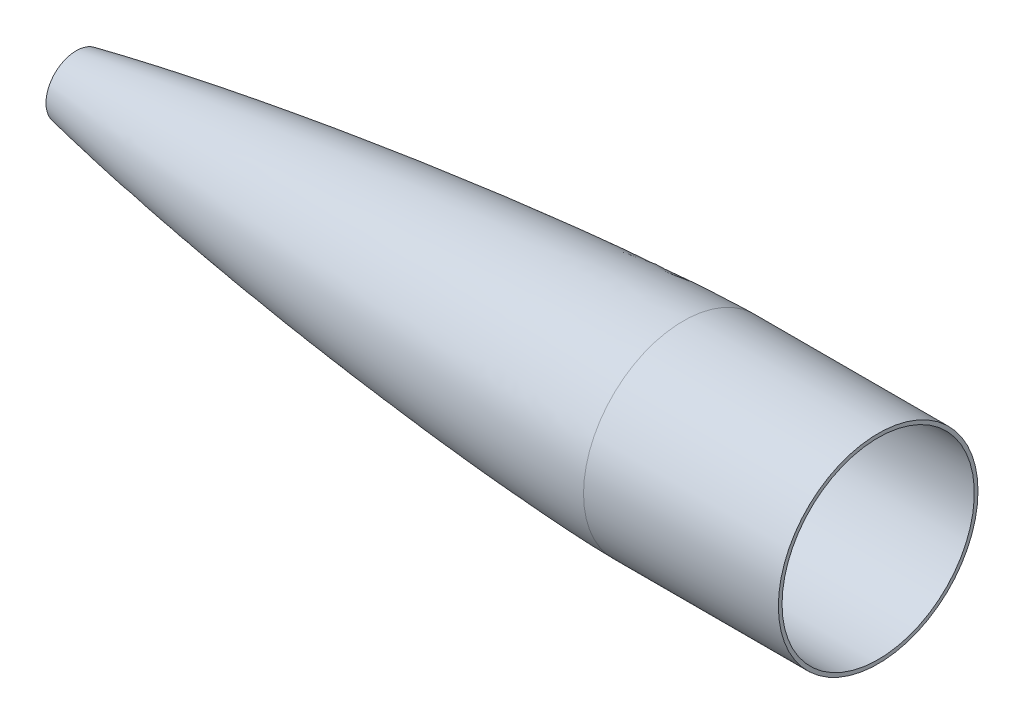
ISO-10303-21;
HEADER;
FILE_DESCRIPTION(('STEP AP214'),'2;1');
FILE_NAME('part.step','',(''),(''),'','','');
FILE_SCHEMA(('AUTOMOTIVE_DESIGN { 1 0 10303 214 1 1 1 1 }'));
ENDSEC;
DATA;
#1=APPLICATION_CONTEXT('core data for automotive mechanical design processes');
#2=APPLICATION_PROTOCOL_DEFINITION('international standard','automotive_design',2000,#1);
#3=PRODUCT_CONTEXT('',#1,'mechanical');
#4=PRODUCT('Part','Part','',(#3));
#5=PRODUCT_RELATED_PRODUCT_CATEGORY('part','',(#4));
#6=PRODUCT_DEFINITION_FORMATION('','',#4);
#7=PRODUCT_DEFINITION_CONTEXT('part definition',#1,'design');
#8=PRODUCT_DEFINITION('design','',#6,#7);
#9=PRODUCT_DEFINITION_SHAPE('','',#8);
#10=(LENGTH_UNIT() NAMED_UNIT(*) SI_UNIT(.MILLI.,.METRE.));
#11=(NAMED_UNIT(*) PLANE_ANGLE_UNIT() SI_UNIT($,.RADIAN.));
#12=(NAMED_UNIT(*) SI_UNIT($,.STERADIAN.) SOLID_ANGLE_UNIT());
#13=UNCERTAINTY_MEASURE_WITH_UNIT(LENGTH_MEASURE(1.E-05),#10,'distance_accuracy_value','');
#14=(GEOMETRIC_REPRESENTATION_CONTEXT(3) GLOBAL_UNCERTAINTY_ASSIGNED_CONTEXT((#13)) GLOBAL_UNIT_ASSIGNED_CONTEXT((#10,
#11,#12)) REPRESENTATION_CONTEXT('',''));
#15=CARTESIAN_POINT('',(0.,0.,0.));
#16=DIRECTION('',(0.,0.,1.));
#17=DIRECTION('',(1.,0.,0.));
#18=AXIS2_PLACEMENT_3D('',#15,#16,#17);
#19=CARTESIAN_POINT('',(27.9569835045705,0.,0.));
#20=DIRECTION('',(-1.,0.,0.));
#21=DIRECTION('',(0.,0.,1.));
#22=AXIS2_PLACEMENT_3D('',#19,#20,#21);
#23=CYLINDRICAL_SURFACE('',#22,41.099994);
#24=CARTESIAN_POINT('',(294.248097670656,0.,0.));
#25=DIRECTION('',(-1.,0.,0.));
#26=DIRECTION('',(0.,0.,1.));
#27=AXIS2_PLACEMENT_3D('',#24,#25,#26);
#28=CIRCLE('',#27,41.099994);
#29=CARTESIAN_POINT('',(294.248097670656,0.,41.099994));
#30=VERTEX_POINT('',#29);
#31=EDGE_CURVE('E10',#30,#30,#28,.T.);
#32=ORIENTED_EDGE('',*,*,#31,.F.);
#33=EDGE_LOOP('',(#32));
#34=FACE_BOUND('',#33,.T.);
#35=CARTESIAN_POINT('',(374.461362015152,0.,0.));
#36=DIRECTION('',(-1.,0.,0.));
#37=DIRECTION('',(0.,0.,1.));
#38=AXIS2_PLACEMENT_3D('',#35,#36,#37);
#39=CIRCLE('',#38,41.099994);
#40=CARTESIAN_POINT('',(374.461362015152,0.,41.099994));
#41=VERTEX_POINT('',#40);
#42=EDGE_CURVE('E37',#41,#41,#39,.T.);
#43=ORIENTED_EDGE('',*,*,#42,.T.);
#44=EDGE_LOOP('',(#43));
#45=FACE_BOUND('',#44,.T.);
#46=ADVANCED_FACE('F30',(#34,#45),#23,.T.);
#47=CARTESIAN_POINT('',(294.248097670656,41.099994,0.));
#48=CARTESIAN_POINT('',(293.349585578984,41.0929766307083,0.));
#49=CARTESIAN_POINT('',(291.552749441752,41.0620120145708,0.));
#50=CARTESIAN_POINT('',(287.959615598992,40.9757312395162,0.));
#51=CARTESIAN_POINT('',(279.731843335379,40.6955904474829,0.));
#52=CARTESIAN_POINT('',(267.77278785745,40.126983688346,0.));
#53=CARTESIAN_POINT('',(252.089784541244,39.1672522410937,0.));
#54=CARTESIAN_POINT('',(233.587543701493,37.7898429209365,0.));
#55=CARTESIAN_POINT('',(215.101974731597,36.2057496701159,0.));
#56=CARTESIAN_POINT('',(196.633402792594,34.4347648268857,0.));
#57=CARTESIAN_POINT('',(178.182568699461,32.4880556238183,0.));
#58=CARTESIAN_POINT('',(159.750571571185,30.370263808706,0.));
#59=CARTESIAN_POINT('',(141.339126247833,28.0808283889295,0.));
#60=CARTESIAN_POINT('',(122.950477297348,25.6144507336649,0.));
#61=CARTESIAN_POINT('',(104.588147950723,22.9593047940946,0.));
#62=CARTESIAN_POINT('',(86.2567835087022,20.0969319952747,0.));
#63=CARTESIAN_POINT('',(67.9644485613736,16.9947995955386,0.));
#64=CARTESIAN_POINT('',(49.7554220048597,13.608995902172,0.));
#65=CARTESIAN_POINT('',(33.8929224206239,10.3082335767929,0.));
#66=CARTESIAN_POINT('',(21.1109853881937,7.28957187002555,0.));
#67=CARTESIAN_POINT('',(12.0631569659046,4.8001398379657,0.));
#68=CARTESIAN_POINT('',(7.04083965915166,3.21251091516102,0.));
#69=CARTESIAN_POINT('',(4.00901358110106,2.1055100653999,0.));
#70=CARTESIAN_POINT('',(2.3272074598022,1.39819501579109,0.));
#71=CARTESIAN_POINT('',(1.39944702482688,0.953571578890638,0.));
#72=CARTESIAN_POINT('',(0.868996869827166,0.666011278433959,0.));
#73=CARTESIAN_POINT('',(0.554676950424698,0.475129112112784,0.));
#74=CARTESIAN_POINT('',(0.368976653655497,0.349691674085785,0.));
#75=CARTESIAN_POINT('',(0.247244705596054,0.258828054370278,0.));
#76=CARTESIAN_POINT('',(0.159124072236465,0.186271130110896,0.));
#77=CARTESIAN_POINT('',(0.0980289359052772,0.130393503108126,0.));
#78=CARTESIAN_POINT('',(0.0516204427505099,0.0815556881046406,0.));
#79=CARTESIAN_POINT('',(0.0199940375063355,0.0404990511720436,0.));
#80=CARTESIAN_POINT('',(0.00649041594704016,0.0182803486310689,0.));
#81=CARTESIAN_POINT('',(0.00182860387418679,0.0062426386909617,0.));
#82=CARTESIAN_POINT('',(0.,0.,0.));
#83=B_SPLINE_CURVE_WITH_KNOTS('',4,(#47,#48,#49,#50,#51,#52,#53,#54,#55,#56,#57,#58,#59,#60,#61,
#62,#63,#64,#65,#66,#67,#68,#69,#70,#71,#72,#73,#74,#75,#76,#77,#78,#79,#80,#81,#82),
.UNSPECIFIED.,.F.,.F.,(5,1,1,1,1,1,1,1,1,1,1,1,1,1,1,1,1,1,1,1,1,1,1,1,1,1,1,1,1,1,1,1,5),(0.,
0.0120599701125952,0.0241199402251903,0.0482398804503805,0.1104935820596,0.172747283844769,
0.235000984013769,0.297254686823773,0.359508386221387,0.421762088339113,0.484015788959948,
0.546269489090148,0.60852319021114,0.670776891466794,0.733030591698496,0.795284289783134,
0.857537990172938,0.919348906793277,0.95047573101264,0.971525230460581,0.983463902787434,
0.99002606304966,0.993781479893161,0.996003962640871,0.997267165840399,0.998121150964244,
0.998715599634537,0.999010469110389,0.999305338586241,0.99965266929312,0.99982633464656,
0.99991316732328,1.),.UNSPECIFIED.);
#84=CARTESIAN_POINT('',(27.9569835045705,0.,0.));
#85=DIRECTION('',(-1.,0.,0.));
#86=AXIS1_PLACEMENT('',#84,#85);
#87=SURFACE_OF_REVOLUTION('',#83,#86);
#88=CARTESIAN_POINT('',(44.2613620151523,0.,0.));
#89=DIRECTION('',(-1.,0.,0.));
#90=DIRECTION('',(0.,0.,1.));
#91=AXIS2_PLACEMENT_3D('',#88,#89,#90);
#92=CIRCLE('',#91,12.4209088225213);
#93=CARTESIAN_POINT('',(44.2613620151523,0.,12.4209088225213));
#94=VERTEX_POINT('',#93);
#95=EDGE_CURVE('E149',#94,#94,#92,.F.);
#96=ORIENTED_EDGE('',*,*,#95,.T.);
#97=EDGE_LOOP('',(#96));
#98=FACE_BOUND('',#97,.T.);
#99=ORIENTED_EDGE('',*,*,#31,.T.);
#100=EDGE_LOOP('',(#99));
#101=FACE_BOUND('',#100,.T.);
#102=ADVANCED_FACE('F53',(#98,#101),#87,.T.);
#103=CARTESIAN_POINT('',(374.461362015152,0.,0.));
#104=DIRECTION('',(-1.,0.,0.));
#105=DIRECTION('',(0.,0.,1.));
#106=AXIS2_PLACEMENT_3D('',#103,#104,#105);
#107=PLANE('',#106);
#108=CARTESIAN_POINT('',(374.461362015152,0.,0.));
#109=DIRECTION('',(-1.,0.,0.));
#110=DIRECTION('',(0.,0.,1.));
#111=AXIS2_PLACEMENT_3D('',#108,#109,#110);
#112=CIRCLE('',#111,39.575994);
#113=CARTESIAN_POINT('',(374.461362015152,0.,39.575994));
#114=VERTEX_POINT('',#113);
#115=EDGE_CURVE('E48',#114,#114,#112,.T.);
#116=ORIENTED_EDGE('',*,*,#115,.T.);
#117=EDGE_LOOP('',(#116));
#118=FACE_BOUND('',#117,.T.);
#119=ORIENTED_EDGE('',*,*,#42,.F.);
#120=EDGE_LOOP('',(#119));
#121=FACE_BOUND('',#120,.T.);
#122=ADVANCED_FACE('F56',(#118,#121),#107,.F.);
#123=CARTESIAN_POINT('',(27.9569835045705,0.,0.));
#124=DIRECTION('',(-1.,0.,0.));
#125=DIRECTION('',(0.,0.,1.));
#126=AXIS2_PLACEMENT_3D('',#123,#124,#125);
#127=CYLINDRICAL_SURFACE('',#126,39.575994);
#128=CARTESIAN_POINT('',(294.259999730352,0.,39.5760404767668));
#129=CARTESIAN_POINT('',(294.259999730349,-0.647562101953458,39.5760542131661));
#130=CARTESIAN_POINT('',(294.259999730347,-1.29512303507392,39.560147416657));
#131=CARTESIAN_POINT('',(294.259999730346,-2.58868549547753,39.4965913889169));
#132=CARTESIAN_POINT('',(294.259999730348,-3.23468702276071,39.4489421576867));
#133=CARTESIAN_POINT('',(294.259999730358,-4.52357360338433,39.3219998915965));
#134=CARTESIAN_POINT('',(294.259999730366,-5.1664586567246,39.2427068567348));
#135=CARTESIAN_POINT('',(294.259999730359,-6.44756373574214,39.0526723373277));
#136=CARTESIAN_POINT('',(294.259999730344,-7.08578376141943,38.9419308527826));
#137=CARTESIAN_POINT('',(294.259999730333,-8.35602120012929,38.6892650597124));
#138=CARTESIAN_POINT('',(294.259999730337,-8.9880386131623,38.5473407511894));
#139=CARTESIAN_POINT('',(294.259999730348,-10.2443482566311,38.232651529126));
#140=CARTESIAN_POINT('',(294.259999730356,-10.8686404870664,38.0598866155837));
#141=CARTESIAN_POINT('',(294.259999730355,-12.1079957865251,37.6839323060009));
#142=CARTESIAN_POINT('',(294.259999730346,-12.7230588555487,37.4807429099614));
#143=CARTESIAN_POINT('',(294.259999730345,-13.9424740925134,37.0444291587465));
#144=CARTESIAN_POINT('',(294.259999730352,-14.5468262604541,36.8113048035703));
#145=CARTESIAN_POINT('',(294.25999973036,-15.7433637576833,36.3156827450759));
#146=CARTESIAN_POINT('',(294.259999730361,-16.3355490869707,36.0531850417553));
#147=CARTESIAN_POINT('',(294.259999730357,-17.5063262805012,35.4994486685928));
#148=CARTESIAN_POINT('',(294.259999730351,-18.0849181447464,35.2082099987554));
#149=CARTESIAN_POINT('',(294.259999730349,-19.2271145298317,34.5976933115373));
#150=CARTESIAN_POINT('',(294.259999730353,-19.7907190506705,34.2784152941544));
#151=CARTESIAN_POINT('',(294.259999730352,-20.901582976203,33.6125890807142));
#152=CARTESIAN_POINT('',(294.259999730347,-21.4488423808979,33.2660408846589));
#153=CARTESIAN_POINT('',(294.259999730343,-22.5256976784342,32.5465091787211));
#154=CARTESIAN_POINT('',(294.259999730345,-23.0552935712727,32.1735256688342));
#155=CARTESIAN_POINT('',(294.25999973035,-24.095546002028,31.4020218852968));
#156=CARTESIAN_POINT('',(294.259999730354,-24.6062025399476,31.0035016116504));
#157=CARTESIAN_POINT('',(294.259999730352,-25.6073460446378,30.1818843707736));
#158=CARTESIAN_POINT('',(294.259999730347,-26.0978330114077,29.7587874035426));
#159=CARTESIAN_POINT('',(294.259999730347,-27.0574557477287,28.8890360531514));
#160=CARTESIAN_POINT('',(294.259999730354,-27.5265915172794,28.4423816699907));
#161=CARTESIAN_POINT('',(294.259999730356,-28.4423816699908,27.5265915172794));
#162=CARTESIAN_POINT('',(294.259999730352,-28.8890360531515,27.0574557477287));
#163=CARTESIAN_POINT('',(294.259999730341,-29.7587874035425,26.0978330114076));
#164=CARTESIAN_POINT('',(294.259999730335,-30.1818843707734,25.6073460446377));
#165=CARTESIAN_POINT('',(294.259999730344,-31.0035016116505,24.6062025399476));
#166=CARTESIAN_POINT('',(294.259999730361,-31.4020218852974,24.095546002028));
#167=CARTESIAN_POINT('',(294.259999730363,-32.1735256688267,23.0552935712823));
#168=CARTESIAN_POINT('',(294.259999730348,-32.5465091787055,22.5256976784536));
#169=CARTESIAN_POINT('',(294.259999730342,-33.2660408846685,21.4488423808875));
#170=CARTESIAN_POINT('',(294.25999973035,-33.6125890807545,20.9015829761514));
#171=CARTESIAN_POINT('',(294.259999730355,-34.2784152941837,19.7907190506062));
#172=CARTESIAN_POINT('',(294.259999730351,-34.5976933115284,19.227114529798));
#173=CARTESIAN_POINT('',(294.259999730346,-35.2082099988138,18.0849181446874));
#174=CARTESIAN_POINT('',(294.259999730344,-35.499448668752,17.5063262803838));
#175=CARTESIAN_POINT('',(294.25999973034,-36.0531850417127,16.3355490868408));
#176=CARTESIAN_POINT('',(294.259999730339,-36.3156827447369,15.7433637576021));
#177=CARTESIAN_POINT('',(294.259999730338,-36.8113048039352,14.546826260472));
#178=CARTESIAN_POINT('',(294.25999973034,-37.0444291601087,13.9424740925803));
#179=CARTESIAN_POINT('',(294.259999730349,-37.4807429085982,12.7230588554847));
#180=CARTESIAN_POINT('',(294.259999730357,-37.6839323009152,12.1079957862813));
#181=CARTESIAN_POINT('',(294.259999730353,-38.0598866206659,10.8686404873222));
#182=CARTESIAN_POINT('',(294.259999730342,-38.2326515480982,10.2443482575662));
#183=CARTESIAN_POINT('',(294.259999730341,-38.547340732217,8.98803861222818));
#184=CARTESIAN_POINT('',(294.259999730353,-38.6892649889054,8.35602119664668));
#185=CARTESIAN_POINT('',(294.259999730357,-38.9419309235996,7.0857837648531));
#186=CARTESIAN_POINT('',(294.25999973035,-39.0526726016015,6.44756374864023));
#187=CARTESIAN_POINT('',(294.259999730338,-39.242706592479,5.16645864370292));
#188=CARTESIAN_POINT('',(294.259999730333,-39.3219989053606,4.52357355497935));
#189=CARTESIAN_POINT('',(294.259999730335,-39.4489431439093,3.23468707129825));
#190=CARTESIAN_POINT('',(294.259999730341,-39.4965950695718,2.58868567634028));
#191=CARTESIAN_POINT('',(294.259999730349,-39.5601437359999,1.29512285425482));
#192=CARTESIAN_POINT('',(294.259999730351,-39.5760404767667,0.6475614271274));
#193=CARTESIAN_POINT('',(294.259999730351,-39.5760404767667,-0.647561427127434));
#194=CARTESIAN_POINT('',(294.259999730349,-39.5601437359999,-1.29512285425485));
#195=CARTESIAN_POINT('',(294.259999730341,-39.4965950695739,-2.58868567629714));
#196=CARTESIAN_POINT('',(294.259999730335,-39.4489431439156,-3.23468707121205));
#197=CARTESIAN_POINT('',(294.259999730333,-39.321998905367,-4.52357355493579));
#198=CARTESIAN_POINT('',(294.259999730338,-39.242706592475,-5.16645864374444));
#199=CARTESIAN_POINT('',(294.25999973035,-39.0526726015928,-6.44756374868434));
#200=CARTESIAN_POINT('',(294.259999730357,-38.941930923605,-7.08578376481593));
#201=CARTESIAN_POINT('',(294.259999730353,-38.6892649889315,-8.35602119652531));
#202=CARTESIAN_POINT('',(294.259999730343,-38.5473407322461,-8.98803861210314));
#203=CARTESIAN_POINT('',(294.25999973034,-38.2326515481225,-10.2443482574779));
#204=CARTESIAN_POINT('',(294.259999730348,-38.0598866206803,-10.8686404872739));
#205=CARTESIAN_POINT('',(294.25999973036,-37.6839323009055,-12.107995786314));
#206=CARTESIAN_POINT('',(294.259999730364,-37.480742908574,-12.7230588555585));
#207=CARTESIAN_POINT('',(294.259999730362,-37.0444291600798,-13.9424740926557));
#208=CARTESIAN_POINT('',(294.259999730356,-36.8113048039199,-14.5468262605093));
#209=CARTESIAN_POINT('',(294.259999730354,-36.3156827447222,-15.743363757638));
#210=CARTESIAN_POINT('',(294.259999730359,-36.0531850416814,-16.3355490869118));
#211=CARTESIAN_POINT('',(294.259999730357,-35.4994486687172,-17.5063262804532));
#212=CARTESIAN_POINT('',(294.25999973035,-35.2082099987955,-18.0849181447216));
#213=CARTESIAN_POINT('',(294.259999730348,-34.5976933115111,-19.2271145298304));
#214=CARTESIAN_POINT('',(294.259999730352,-34.2784152941474,-19.7907190506702));
#215=CARTESIAN_POINT('',(294.259999730352,-33.6125890807151,-20.9015829762136));
#216=CARTESIAN_POINT('',(294.259999730347,-33.2660408846481,-21.4488423809181));
#217=CARTESIAN_POINT('',(294.259999730343,-32.5465091787317,-22.5256976784143));
#218=CARTESIAN_POINT('',(294.259999730345,-32.173525668881,-23.055293571205));
#219=CARTESIAN_POINT('',(294.25999973035,-31.4020218853717,-24.0955460019317));
#220=CARTESIAN_POINT('',(294.259999730354,-31.003501611714,-24.6062025398682));
#221=CARTESIAN_POINT('',(294.259999730353,-30.181884370809,-25.6073460445966));
#222=CARTESIAN_POINT('',(294.259999730349,-29.7587874035608,-26.0978330113875));
#223=CARTESIAN_POINT('',(294.259999730345,-28.8890360531514,-27.0574557477287));
#224=CARTESIAN_POINT('',(294.259999730345,-28.4423816699907,-27.5265915172793));
#225=CARTESIAN_POINT('',(294.259999730352,-27.5265915172692,-28.4423816700009));
#226=CARTESIAN_POINT('',(294.259999730359,-27.0574557477079,-28.8890360531714));
#227=CARTESIAN_POINT('',(294.25999973036,-26.0978330113859,-29.7587874035614));
#228=CARTESIAN_POINT('',(294.259999730353,-25.6073460446266,-30.1818843707826));
#229=CARTESIAN_POINT('',(294.259999730353,-24.6062025399112,-31.0035016116805));
#230=CARTESIAN_POINT('',(294.259999730359,-24.0955460019536,-31.4020218853555));
#231=CARTESIAN_POINT('',(294.259999730364,-23.0552935712051,-32.1735256688811));
#232=CARTESIAN_POINT('',(294.259999730362,-22.5256976784144,-32.5465091787319));
#233=CARTESIAN_POINT('',(294.259999730358,-21.4488423808875,-33.2660408846686));
#234=CARTESIAN_POINT('',(294.259999730355,-20.9015829761514,-33.6125890807545));
#235=CARTESIAN_POINT('',(294.259999730349,-19.7907190506061,-34.2784152941836));
#236=CARTESIAN_POINT('',(294.259999730347,-19.227114529798,-34.5976933115284));
#237=CARTESIAN_POINT('',(294.259999730353,-18.0849181446874,-35.2082099988138));
#238=CARTESIAN_POINT('',(294.259999730362,-17.5063262803839,-35.4994486687521));
#239=CARTESIAN_POINT('',(294.259999730356,-16.3355490868396,-36.0531850417135));
#240=CARTESIAN_POINT('',(294.259999730342,-15.7433637575996,-36.3156827447381));
#241=CARTESIAN_POINT('',(294.259999730337,-14.54682626047,-36.811304803936));
#242=CARTESIAN_POINT('',(294.259999730347,-13.9424740925802,-37.0444291601087));
#243=CARTESIAN_POINT('',(294.259999730348,-12.7230588554537,-37.4807429086093));
#244=CARTESIAN_POINT('',(294.259999730339,-12.1079957862168,-37.6839323009364));
#245=CARTESIAN_POINT('',(294.259999730337,-10.8686404872312,-38.0598866206916));
#246=CARTESIAN_POINT('',(294.259999730343,-10.2443482574827,-38.2326515481204));
#247=CARTESIAN_POINT('',(294.259999730342,-8.98803861215706,-38.5473407322335));
#248=CARTESIAN_POINT('',(294.259999730335,-8.35602119658026,-38.6892649889195));
#249=CARTESIAN_POINT('',(294.259999730343,-7.08578376483722,-38.9419309236016));
#250=CARTESIAN_POINT('',(294.259999730359,-6.44756374867059,-39.0526726015957));
#251=CARTESIAN_POINT('',(294.259999730367,-5.16645864370074,-39.2427065924809));
#252=CARTESIAN_POINT('',(294.259999730358,-4.52357355489747,-39.3219989053715));
#253=CARTESIAN_POINT('',(294.259999730348,-3.23468707118456,-39.4489431439179));
#254=CARTESIAN_POINT('',(294.259999730345,-2.5886856762751,-39.4965950695753));
#255=CARTESIAN_POINT('',(294.259999730348,-1.29512285424378,-39.5601437360001));
#256=CARTESIAN_POINT('',(294.259999730352,-0.647561427121885,-39.5760404767668));
#257=CARTESIAN_POINT('',(294.259999730352,0.64756142712189,-39.5760404767668));
#258=CARTESIAN_POINT('',(294.259999730348,1.29512285424377,-39.5601437360001));
#259=CARTESIAN_POINT('',(294.259999730345,2.58868567631825,-39.4965950695732));
#260=CARTESIAN_POINT('',(294.259999730348,3.23468707127077,-39.4489431439115));
#261=CARTESIAN_POINT('',(294.259999730358,4.52357355498326,-39.3219989053609));
#262=CARTESIAN_POINT('',(294.259999730367,5.16645864374347,-39.2427065924745));
#263=CARTESIAN_POINT('',(294.259999730359,6.44756374867058,-39.0526726015957));
#264=CARTESIAN_POINT('',(294.259999730342,7.08578376483721,-38.9419309236016));
#265=CARTESIAN_POINT('',(294.259999730334,8.3560211966185,-38.6892649889119));
#266=CARTESIAN_POINT('',(294.259999730341,8.98803861223317,-38.5473407322164));
#267=CARTESIAN_POINT('',(294.259999730344,10.2443482575947,-38.2326515480904));
#268=CARTESIAN_POINT('',(294.259999730339,10.8686404873416,-38.05988662066));
#269=CARTESIAN_POINT('',(294.259999730338,12.1079957862537,-37.6839323009232));
#270=CARTESIAN_POINT('',(294.259999730342,12.7230588554196,-37.4807429086195));
#271=CARTESIAN_POINT('',(294.259999730352,13.9424740925116,-37.0444291601352));
#272=CARTESIAN_POINT('',(294.259999730358,14.5468262604361,-36.8113048039502));
#273=CARTESIAN_POINT('',(294.259999730354,15.7433637575846,-36.3156827447444));
#274=CARTESIAN_POINT('',(294.259999730345,16.3355490868098,-36.0531850417266));
#275=CARTESIAN_POINT('',(294.259999730341,17.5063262803433,-35.499448668772));
#276=CARTESIAN_POINT('',(294.259999730347,18.0849181446504,-35.2082099988329));
#277=CARTESIAN_POINT('',(294.259999730353,19.2271145297921,-34.5976933115323));
#278=CARTESIAN_POINT('',(294.259999730353,19.7907190506274,-34.278415294172));
#279=CARTESIAN_POINT('',(294.259999730356,20.9015829761927,-33.6125890807287));
#280=CARTESIAN_POINT('',(294.25999973036,21.4488423809229,-33.2660408846457));
#281=CARTESIAN_POINT('',(294.259999730364,22.5256976784411,-32.5465091787133));
#282=CARTESIAN_POINT('',(294.259999730365,23.0552935712292,-32.1735256688638));
#283=CARTESIAN_POINT('',(294.259999730362,24.0955460019348,-31.4020218853689));
#284=CARTESIAN_POINT('',(294.259999730359,24.6062025398537,-31.0035016117251));
#285=CARTESIAN_POINT('',(294.259999730352,25.6073460445782,-30.1818843708249));
#286=CARTESIAN_POINT('',(294.25999973035,26.0978330113819,-29.7587874035661));
#287=CARTESIAN_POINT('',(294.259999730348,27.0574557477218,-28.8890360531575));
#288=CARTESIAN_POINT('',(294.259999730349,27.5265915172595,-28.4423816700095));
#289=CARTESIAN_POINT('',(294.259999730352,28.4423816699891,-27.526591517282));
#290=CARTESIAN_POINT('',(294.259999730354,28.889036053179,-27.0574557477004));
#291=CARTESIAN_POINT('',(294.259999730357,29.7587874036057,-26.0978330113361));
#292=CARTESIAN_POINT('',(294.259999730358,30.1818843708441,-25.6073460445549));
#293=CARTESIAN_POINT('',(294.259999730353,31.0035016117251,-24.6062025398537));
#294=CARTESIAN_POINT('',(294.259999730348,31.4020218853688,-24.0955460019348));
#295=CARTESIAN_POINT('',(294.259999730351,32.1735256688637,-23.0552935712291));
#296=CARTESIAN_POINT('',(294.25999973036,32.5465091787133,-22.5256976784411));
#297=CARTESIAN_POINT('',(294.259999730364,33.2660408846539,-21.4488423809107));
#298=CARTESIAN_POINT('',(294.259999730358,33.6125890807444,-20.9015829761678));
#299=CARTESIAN_POINT('',(294.259999730351,34.2784152941813,-19.7907190506104));
#300=CARTESIAN_POINT('',(294.259999730348,34.5976933115292,-19.2271145297967));
#301=CARTESIAN_POINT('',(294.259999730346,35.2082099988151,-18.0849181446846));
#302=CARTESIAN_POINT('',(294.259999730346,35.4994486687512,-17.5063262803852));
#303=CARTESIAN_POINT('',(294.259999730343,36.0531850417216,-16.3355490868224));
#304=CARTESIAN_POINT('',(294.259999730339,36.3156827447561,-15.743363757559));
#305=CARTESIAN_POINT('',(294.259999730342,36.811304803964,-14.5468262603994));
#306=CARTESIAN_POINT('',(294.259999730349,37.0444291601379,-13.9424740925032));
#307=CARTESIAN_POINT('',(294.259999730348,37.4807429086257,-12.7230588554034));
#308=CARTESIAN_POINT('',(294.25999973034,37.683932300941,-12.1079957862003));
#309=CARTESIAN_POINT('',(294.259999730339,38.059886620686,-10.8686404872507));
#310=CARTESIAN_POINT('',(294.259999730345,38.2326515481147,-10.2443482575039));
#311=CARTESIAN_POINT('',(294.259999730343,38.5473407322286,-8.98803861217842));
#312=CARTESIAN_POINT('',(294.259999730334,38.6892649889152,-8.35602119660018));
#313=CARTESIAN_POINT('',(294.259999730346,38.9419309235982,-7.08578376485576));
#314=CARTESIAN_POINT('',(294.259999730365,39.0526726015927,-6.4475637486892));
#315=CARTESIAN_POINT('',(294.259999730363,39.2427065924724,-5.16645864375959));
#316=CARTESIAN_POINT('',(294.259999730342,39.3219989053593,-4.52357355499678));
#317=CARTESIAN_POINT('',(294.259999730331,39.4489431439107,-3.23468707128003));
#318=CARTESIAN_POINT('',(294.259999730342,39.4965950695727,-2.58868567632584));
#319=CARTESIAN_POINT('',(294.259999730353,39.5601437360001,-1.29512285424772));
#320=CARTESIAN_POINT('',(294.259999730354,39.5760404767668,-0.647561427123861));
#321=CARTESIAN_POINT('',(294.259999730352,39.5760404767668,0.647561427123861));
#322=CARTESIAN_POINT('',(294.259999730349,39.560143736,1.29512285424772));
#323=CARTESIAN_POINT('',(294.259999730347,39.4965950695748,2.58868567628325));
#324=CARTESIAN_POINT('',(294.259999730349,39.4489431439171,3.23468707119494));
#325=CARTESIAN_POINT('',(294.259999730359,39.3219989053699,4.5235735549121));
#326=CARTESIAN_POINT('',(294.259999730368,39.2427065924787,5.16645864371741));
#327=CARTESIAN_POINT('',(294.259999730359,39.0526726015927,6.4475637486892));
#328=CARTESIAN_POINT('',(294.259999730341,38.9419309235982,7.08578376485575));
#329=CARTESIAN_POINT('',(294.259999730339,38.6892649889072,8.35602119664096));
#330=CARTESIAN_POINT('',(294.259999730356,38.5473407322104,8.98803861225959));
#331=CARTESIAN_POINT('',(294.259999730366,38.232651548082,10.2443482576269));
#332=CARTESIAN_POINT('',(294.25999973036,38.0598866206505,10.8686404873756));
#333=CARTESIAN_POINT('',(294.259999730352,37.6839323009134,12.1079957862842));
#334=CARTESIAN_POINT('',(294.25999973035,37.4807429086109,12.723058855445));
#335=CARTESIAN_POINT('',(294.259999730344,37.0444291601406,13.9424740924955));
#336=CARTESIAN_POINT('',(294.259999730341,36.8113048039699,14.5468262603841));
#337=CARTESIAN_POINT('',(294.25999973034,36.3156827447627,15.7433637575441));
#338=CARTESIAN_POINT('',(294.259999730343,36.0531850417251,16.335549086815));
#339=CARTESIAN_POINT('',(294.259999730345,35.4994486687512,17.5063262803852));
#340=CARTESIAN_POINT('',(294.259999730345,35.2082099988151,18.0849181446846));
#341=CARTESIAN_POINT('',(294.259999730348,34.5976933115292,19.2271145297967));
#342=CARTESIAN_POINT('',(294.259999730351,34.2784152941813,19.7907190506104));
#343=CARTESIAN_POINT('',(294.259999730358,33.6125890807444,20.9015829761678));
#344=CARTESIAN_POINT('',(294.259999730363,33.2660408846539,21.4488423809107));
#345=CARTESIAN_POINT('',(294.259999730361,32.5465091787324,22.5256976784125));
#346=CARTESIAN_POINT('',(294.259999730355,32.1735256689034,23.0552935711728));
#347=CARTESIAN_POINT('',(294.259999730345,31.4020218853914,24.0955460019071));
#348=CARTESIAN_POINT('',(294.259999730342,31.003501611706,24.6062025398793));
#349=CARTESIAN_POINT('',(294.259999730342,30.1818843707806,25.6073460446296));
#350=CARTESIAN_POINT('',(294.259999730346,29.7587874035418,26.0978330114087));
#351=CARTESIAN_POINT('',(294.259999730352,28.8890360531453,27.0574557477352));
#352=CARTESIAN_POINT('',(294.259999730354,28.4423816699876,27.5265915172825));
#353=CARTESIAN_POINT('',(294.259999730361,27.5265915172815,28.4423816699887));
#354=CARTESIAN_POINT('',(294.259999730365,27.0574557477331,28.8890360531474));
#355=CARTESIAN_POINT('',(294.259999730358,26.0978330114066,29.7587874035439));
#356=CARTESIAN_POINT('',(294.259999730345,25.6073460446285,30.1818843707817));
#357=CARTESIAN_POINT('',(294.259999730338,24.6062025399158,31.0035016116759));
#358=CARTESIAN_POINT('',(294.259999730344,24.0955460019815,31.4020218853328));
#359=CARTESIAN_POINT('',(294.259999730355,23.05529357125,32.1735256688495));
#360=CARTESIAN_POINT('',(294.259999730362,22.5256976784518,32.5465091787081));
#361=CARTESIAN_POINT('',(294.259999730363,21.4488423809228,33.2660408846438));
#362=CARTESIAN_POINT('',(294.259999730357,20.9015829761924,33.6125890807216));
#363=CARTESIAN_POINT('',(294.259999730352,19.7907190506277,34.278415294179));
#364=CARTESIAN_POINT('',(294.259999730352,19.2271145297934,34.5976933115585));
#365=CARTESIAN_POINT('',(294.259999730348,18.0849181446914,35.2082099987841));
#366=CARTESIAN_POINT('',(294.259999730345,17.5063262804242,35.4994486686311));
#367=CARTESIAN_POINT('',(294.259999730341,16.3355490869023,36.0531850417855));
#368=CARTESIAN_POINT('',(294.259999730339,15.7433637576467,36.315682745091));
#369=CARTESIAN_POINT('',(294.25999973034,14.5468262604553,36.8113048035696));
#370=CARTESIAN_POINT('',(294.259999730342,13.9424740925199,37.0444291587439));
#371=CARTESIAN_POINT('',(294.25999973035,12.7230588555661,37.4807429099554));
#372=CARTESIAN_POINT('',(294.259999730356,12.107995786548,37.6839323059935));
#373=CARTESIAN_POINT('',(294.259999730354,10.8686404870581,38.0598866155868));
#374=CARTESIAN_POINT('',(294.259999730347,10.2443482565855,38.2326515291389));
#375=CARTESIAN_POINT('',(294.259999730338,8.98803861308409,38.5473407512076));
#376=CARTESIAN_POINT('',(294.259999730337,8.35602120005634,38.6892650597281));
#377=CARTESIAN_POINT('',(294.259999730341,7.08578376139954,38.9419308527854));
#378=CARTESIAN_POINT('',(294.259999730346,6.44756373577049,39.0526723373221));
#379=CARTESIAN_POINT('',(294.259999730344,5.16645865680838,39.2427068567235));
#380=CARTESIAN_POINT('',(294.259999730336,4.523573603475,39.3219998915858));
#381=CARTESIAN_POINT('',(294.259999730335,3.2346870228204,39.4489421576823));
#382=CARTESIAN_POINT('',(294.259999730341,2.58868549549914,39.496591388916));
#383=CARTESIAN_POINT('',(294.259999730352,1.29512303506287,39.5601474166573));
#384=CARTESIAN_POINT('',(294.259999730356,0.647562101947921,39.5760542131662));
#385=CARTESIAN_POINT('',(294.259999730352,0.,39.5760404767668));
#386=B_SPLINE_CURVE_WITH_KNOTS('',3,(#128,#129,#130,#131,#132,#133,#134,#135,#136,#137,#138,
#139,#140,#141,#142,#143,#144,#145,#146,#147,#148,#149,#150,#151,#152,#153,#154,#155,#156,#157,
#158,#159,#160,#161,#162,#163,#164,#165,#166,#167,#168,#169,#170,#171,#172,#173,#174,#175,#176,
#177,#178,#179,#180,#181,#182,#183,#184,#185,#186,#187,#188,#189,#190,#191,#192,#193,#194,#195,
#196,#197,#198,#199,#200,#201,#202,#203,#204,#205,#206,#207,#208,#209,#210,#211,#212,#213,#214,
#215,#216,#217,#218,#219,#220,#221,#222,#223,#224,#225,#226,#227,#228,#229,#230,#231,#232,#233,
#234,#235,#236,#237,#238,#239,#240,#241,#242,#243,#244,#245,#246,#247,#248,#249,#250,#251,#252,
#253,#254,#255,#256,#257,#258,#259,#260,#261,#262,#263,#264,#265,#266,#267,#268,#269,#270,#271,
#272,#273,#274,#275,#276,#277,#278,#279,#280,#281,#282,#283,#284,#285,#286,#287,#288,#289,#290,
#291,#292,#293,#294,#295,#296,#297,#298,#299,#300,#301,#302,#303,#304,#305,#306,#307,#308,#309,
#310,#311,#312,#313,#314,#315,#316,#317,#318,#319,#320,#321,#322,#323,#324,#325,#326,#327,#328,
#329,#330,#331,#332,#333,#334,#335,#336,#337,#338,#339,#340,#341,#342,#343,#344,#345,#346,#347,
#348,#349,#350,#351,#352,#353,#354,#355,#356,#357,#358,#359,#360,#361,#362,#363,#364,#365,#366,
#367,#368,#369,#370,#371,#372,#373,#374,#375,#376,#377,#378,#379,#380,#381,#382,#383,#384,#385),
.UNSPECIFIED.,.F.,.F.,(4,2,2,2,2,2,2,2,2,2,2,2,2,2,2,2,2,2,2,2,2,2,2,2,2,2,2,2,2,2,2,2,2,2,2,2,
2,2,2,2,2,2,2,2,2,2,2,2,2,2,2,2,2,2,2,2,2,2,2,2,2,2,2,2,2,2,2,2,2,2,2,2,2,2,2,2,2,2,2,2,2,2,2,2,
2,2,2,2,2,2,2,2,2,2,2,2,2,2,2,2,2,2,2,2,2,2,2,2,2,2,2,2,2,2,2,2,2,2,2,2,2,2,2,2,2,2,2,2,4),(0.,
1.94248930674543,3.88497861344463,5.82746792024928,7.76995722704057,9.71244653369788,
11.6549358404666,13.5974251471702,15.5399144539305,17.4824037608536,19.4248930674758,
21.3673823742501,23.3098716808778,25.2523609878262,27.1948502944729,29.1373396011741,
31.0798289079155,33.0223182146569,34.964807521358,36.9072968280048,38.8497861349175,
40.7922754416912,42.7347647483551,44.6772540551824,46.6197433619005,48.5622326686608,
50.504721975355,52.4472112821331,54.3897005887967,56.3321898957065,58.2746792022552,
60.2171685090855,62.159657815831,64.1021471225764,66.0446364292771,67.9871257360826,
69.9296150427454,71.8721043493963,73.8145936562976,75.7570829631222,77.6995722697614,
79.6420615765958,81.5845508833068,83.5270401900811,85.4695294967445,87.4120188035156,
89.3545081102224,91.2969974170051,93.2394867237465,95.1819760305311,97.124465337189,
99.0669546439774,101.009443950748,102.951933257522,104.894422564186,106.836911871013,
108.779401177736,110.72189048449,112.664379791289,114.606869098042,116.54935840469,
118.49184771146,120.434337018249,122.376826324933,124.319315631662,126.261804938391,
128.204294245205,130.146783551864,132.089272858634,134.031762165399,135.974251472149,
137.916740778724,139.859230085588,141.801719392262,143.7442086991,145.686698005857,
147.629187312611,149.571676619373,151.514165926013,153.456655232845,155.399144539532,
157.341633846401,159.284123153142,161.226612459782,163.169101766544,165.111591073342,
167.054080380025,168.996569686838,170.939058993636,172.881548300409,174.824037607101,
176.76652691385,178.709016220503,180.651505527272,182.593994833939,184.536484140758,
186.478973447493,188.421462754228,190.363952060919,192.306441367714,194.248930674483,
196.191419981261,198.133909288017,200.076398594577,202.018887901325,203.961377208148,
205.903866514961,207.846355821644,209.788845128442,211.731334435101,213.673823741943,
215.61631304868,217.558802355408,219.501291662141,221.443780968874,223.386270275574,
225.328759582375,227.271248889129,229.213738195886,231.15622750258,233.098716809398,
235.041206116141,236.983695422828,238.926184729712,240.868674036352,242.811163342997,
244.753652649781,246.696141956595,248.638631263324),.UNSPECIFIED.);
#387=CARTESIAN_POINT('',(294.259999730352,0.,39.5760404767668));
#388=VERTEX_POINT('',#387);
#389=EDGE_CURVE('E41',#388,#388,#386,.F.);
#390=ORIENTED_EDGE('',*,*,#389,.T.);
#391=EDGE_LOOP('',(#390));
#392=FACE_BOUND('',#391,.T.);
#393=ORIENTED_EDGE('',*,*,#115,.F.);
#394=EDGE_LOOP('',(#393));
#395=FACE_BOUND('',#394,.T.);
#396=ADVANCED_FACE('F60',(#392,#395),#127,.F.);
#397=CARTESIAN_POINT('',(294.248097670656,41.099994,0.));
#398=CARTESIAN_POINT('',(293.349585578984,41.0929766307083,0.));
#399=CARTESIAN_POINT('',(291.552749441752,41.0620120145708,0.));
#400=CARTESIAN_POINT('',(287.959615598992,40.9757312395162,0.));
#401=CARTESIAN_POINT('',(279.731843335379,40.6955904474829,0.));
#402=CARTESIAN_POINT('',(267.77278785745,40.126983688346,0.));
#403=CARTESIAN_POINT('',(252.089784541244,39.1672522410937,0.));
#404=CARTESIAN_POINT('',(233.587543701493,37.7898429209365,0.));
#405=CARTESIAN_POINT('',(215.101974731597,36.2057496701159,0.));
#406=CARTESIAN_POINT('',(196.633402792594,34.4347648268857,0.));
#407=CARTESIAN_POINT('',(178.182568699461,32.4880556238183,0.));
#408=CARTESIAN_POINT('',(159.750571571185,30.370263808706,0.));
#409=CARTESIAN_POINT('',(141.339126247833,28.0808283889295,0.));
#410=CARTESIAN_POINT('',(122.950477297348,25.6144507336649,0.));
#411=CARTESIAN_POINT('',(104.588147950723,22.9593047940946,0.));
#412=CARTESIAN_POINT('',(86.2567835087022,20.0969319952747,0.));
#413=CARTESIAN_POINT('',(67.9644485613736,16.9947995955386,0.));
#414=CARTESIAN_POINT('',(49.7554220048597,13.608995902172,0.));
#415=CARTESIAN_POINT('',(33.8929224206239,10.3082335767929,0.));
#416=CARTESIAN_POINT('',(21.1109853881937,7.28957187002555,0.));
#417=CARTESIAN_POINT('',(12.0631569659046,4.8001398379657,0.));
#418=CARTESIAN_POINT('',(7.04083965915166,3.21251091516102,0.));
#419=CARTESIAN_POINT('',(4.21971082672461,2.1824412692167,0.));
#420=CARTESIAN_POINT('',(2.89397336988742,1.63497943551556,0.));
#421=CARTESIAN_POINT('',(2.3959998911713,1.41476933945791,0.));
#422=CARTESIAN_POINT('',(2.34523535757127,1.39215927000974,0.));
#423=B_SPLINE_CURVE_WITH_KNOTS('',4,(#397,#398,#399,#400,#401,#402,#403,#404,#405,#406,#407,
#408,#409,#410,#411,#412,#413,#414,#415,#416,#417,#418,#419,#420,#421,#422),.UNSPECIFIED.,.F.,
.F.,(5,1,1,1,1,1,1,1,1,1,1,1,1,1,1,1,1,1,1,1,1,1,5),(0.,0.0120599701125952,0.0241199402251903,
0.0482398804503805,0.1104935820596,0.172747283844769,0.235000984013769,0.297254686823773,
0.359508386221387,0.421762088339113,0.484015788959948,0.546269489090148,0.60852319021114,
0.670776891466794,0.733030591698496,0.795284289783134,0.857537990172938,0.919348906793277,
0.95047573101264,0.971525230460581,0.983463902787434,0.99002606304966,0.990771939842415),.UNSPECIFIED.);
#424=CARTESIAN_POINT('',(27.9569835045705,0.,0.));
#425=DIRECTION('',(-1.,0.,0.));
#426=AXIS1_PLACEMENT('',#424,#425);
#427=SURFACE_OF_REVOLUTION('',#423,#426);
#428=OFFSET_SURFACE('',#427,-1.524,.F.);
#429=CARTESIAN_POINT('',(44.2613620151523,0.,0.));
#430=DIRECTION('',(-1.,0.,0.));
#431=DIRECTION('',(0.,0.,1.));
#432=AXIS2_PLACEMENT_3D('',#429,#430,#431);
#433=CIRCLE('',#432,10.8652442071501);
#434=CARTESIAN_POINT('',(44.2613620151523,0.,10.8652442071501));
#435=VERTEX_POINT('',#434);
#436=EDGE_CURVE('E33',#435,#435,#433,.F.);
#437=ORIENTED_EDGE('',*,*,#436,.F.);
#438=EDGE_LOOP('',(#437));
#439=FACE_BOUND('',#438,.T.);
#440=ORIENTED_EDGE('',*,*,#389,.F.);
#441=EDGE_LOOP('',(#440));
#442=FACE_BOUND('',#441,.T.);
#443=ADVANCED_FACE('F65',(#439,#442),#428,.F.);
#444=CARTESIAN_POINT('',(44.2613620151522,0.,0.));
#445=DIRECTION('',(1.,0.,0.));
#446=DIRECTION('',(0.,0.,-1.));
#447=AXIS2_PLACEMENT_3D('',#444,#445,#446);
#448=PLANE('',#447);
#449=ORIENTED_EDGE('',*,*,#436,.T.);
#450=EDGE_LOOP('',(#449));
#451=FACE_BOUND('',#450,.T.);
#452=ORIENTED_EDGE('',*,*,#95,.F.);
#453=EDGE_LOOP('',(#452));
#454=FACE_BOUND('',#453,.T.);
#455=ADVANCED_FACE('F99',(#451,#454),#448,.F.);
#456=CLOSED_SHELL('',(#46,#102,#122,#396,#443,#455));
#457=MANIFOLD_SOLID_BREP('B2',#456);
#458=ADVANCED_BREP_SHAPE_REPRESENTATION('',(#18,#457),#14);
#459=SHAPE_DEFINITION_REPRESENTATION(#9,#458);
ENDSEC;
END-ISO-10303-21;
